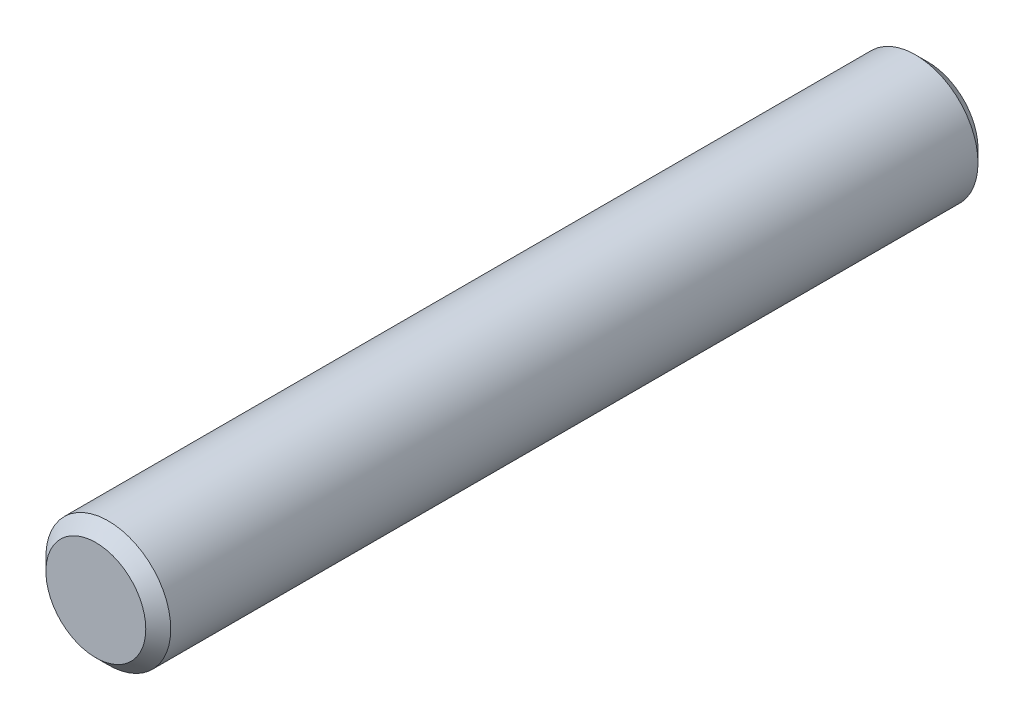
ISO-10303-21;
HEADER;
FILE_DESCRIPTION(('STEP AP214'),'2;1');
FILE_NAME('part.step','',(''),(''),'','','');
FILE_SCHEMA(('AUTOMOTIVE_DESIGN { 1 0 10303 214 1 1 1 1 }'));
ENDSEC;
DATA;
#1=APPLICATION_CONTEXT('core data for automotive mechanical design processes');
#2=APPLICATION_PROTOCOL_DEFINITION('international standard','automotive_design',2000,#1);
#3=PRODUCT_CONTEXT('',#1,'mechanical');
#4=PRODUCT('Part','Part','',(#3));
#5=PRODUCT_RELATED_PRODUCT_CATEGORY('part','',(#4));
#6=PRODUCT_DEFINITION_FORMATION('','',#4);
#7=PRODUCT_DEFINITION_CONTEXT('part definition',#1,'design');
#8=PRODUCT_DEFINITION('design','',#6,#7);
#9=PRODUCT_DEFINITION_SHAPE('','',#8);
#10=(LENGTH_UNIT() NAMED_UNIT(*) SI_UNIT(.MILLI.,.METRE.));
#11=(NAMED_UNIT(*) PLANE_ANGLE_UNIT() SI_UNIT($,.RADIAN.));
#12=(NAMED_UNIT(*) SI_UNIT($,.STERADIAN.) SOLID_ANGLE_UNIT());
#13=UNCERTAINTY_MEASURE_WITH_UNIT(LENGTH_MEASURE(1.E-05),#10,'distance_accuracy_value','');
#14=(GEOMETRIC_REPRESENTATION_CONTEXT(3) GLOBAL_UNCERTAINTY_ASSIGNED_CONTEXT((#13)) GLOBAL_UNIT_ASSIGNED_CONTEXT((#10,
#11,#12)) REPRESENTATION_CONTEXT('',''));
#15=CARTESIAN_POINT('',(0.,0.,0.));
#16=DIRECTION('',(0.,0.,1.));
#17=DIRECTION('',(1.,0.,0.));
#18=AXIS2_PLACEMENT_3D('',#15,#16,#17);
#19=CARTESIAN_POINT('',(0.,0.,10.));
#20=DIRECTION('',(0.,0.,-1.));
#21=DIRECTION('',(-1.,0.,0.));
#22=AXIS2_PLACEMENT_3D('',#19,#20,#21);
#23=CYLINDRICAL_SURFACE('',#22,1.5);
#24=CARTESIAN_POINT('',(0.,0.,-9.7));
#25=DIRECTION('',(0.,0.,1.));
#26=DIRECTION('',(1.,0.,0.));
#27=AXIS2_PLACEMENT_3D('',#24,#25,#26);
#28=CIRCLE('',#27,1.5);
#29=CARTESIAN_POINT('',(1.5,0.,-9.7));
#30=VERTEX_POINT('',#29);
#31=EDGE_CURVE('E48',#30,#30,#28,.T.);
#32=ORIENTED_EDGE('',*,*,#31,.T.);
#33=EDGE_LOOP('',(#32));
#34=FACE_BOUND('',#33,.T.);
#35=CARTESIAN_POINT('',(0.,0.,9.7));
#36=DIRECTION('',(0.,0.,1.));
#37=DIRECTION('',(1.,0.,0.));
#38=AXIS2_PLACEMENT_3D('',#35,#36,#37);
#39=CIRCLE('',#38,1.5);
#40=CARTESIAN_POINT('',(1.5,0.,9.7));
#41=VERTEX_POINT('',#40);
#42=EDGE_CURVE('E52',#41,#41,#39,.F.);
#43=ORIENTED_EDGE('',*,*,#42,.T.);
#44=EDGE_LOOP('',(#43));
#45=FACE_BOUND('',#44,.T.);
#46=ADVANCED_FACE('F36',(#34,#45),#23,.T.);
#47=CARTESIAN_POINT('',(0.,0.,10.));
#48=DIRECTION('',(0.,0.,1.));
#49=DIRECTION('',(1.,0.,0.));
#50=AXIS2_PLACEMENT_3D('',#47,#48,#49);
#51=PLANE('',#50);
#52=CARTESIAN_POINT('',(0.,0.,10.));
#53=DIRECTION('',(0.,0.,1.));
#54=DIRECTION('',(1.,0.,0.));
#55=AXIS2_PLACEMENT_3D('',#52,#53,#54);
#56=CIRCLE('',#55,1.2);
#57=CARTESIAN_POINT('',(1.2,0.,10.));
#58=VERTEX_POINT('',#57);
#59=EDGE_CURVE('E10',#58,#58,#56,.T.);
#60=ORIENTED_EDGE('',*,*,#59,.T.);
#61=EDGE_LOOP('',(#60));
#62=FACE_BOUND('',#61,.T.);
#63=ADVANCED_FACE('F68',(#62),#51,.T.);
#64=CARTESIAN_POINT('',(0.,0.,-10.));
#65=DIRECTION('',(0.,0.,1.));
#66=DIRECTION('',(1.,0.,0.));
#67=AXIS2_PLACEMENT_3D('',#64,#65,#66);
#68=PLANE('',#67);
#69=CARTESIAN_POINT('',(0.,0.,-10.));
#70=DIRECTION('',(0.,0.,1.));
#71=DIRECTION('',(1.,0.,0.));
#72=AXIS2_PLACEMENT_3D('',#69,#70,#71);
#73=CIRCLE('',#72,1.2);
#74=CARTESIAN_POINT('',(1.2,0.,-10.));
#75=VERTEX_POINT('',#74);
#76=EDGE_CURVE('E44',#75,#75,#73,.F.);
#77=ORIENTED_EDGE('',*,*,#76,.T.);
#78=EDGE_LOOP('',(#77));
#79=FACE_BOUND('',#78,.T.);
#80=ADVANCED_FACE('F65',(#79),#68,.F.);
#81=CARTESIAN_POINT('',(0.,0.,-9.7));
#82=DIRECTION('',(0.,0.,1.));
#83=DIRECTION('',(1.,0.,0.));
#84=AXIS2_PLACEMENT_3D('',#81,#82,#83);
#85=CONICAL_SURFACE('',#84,1.5,0.785398163397452);
#86=ORIENTED_EDGE('',*,*,#76,.F.);
#87=EDGE_LOOP('',(#86));
#88=FACE_BOUND('',#87,.T.);
#89=ORIENTED_EDGE('',*,*,#31,.F.);
#90=EDGE_LOOP('',(#89));
#91=FACE_BOUND('',#90,.T.);
#92=ADVANCED_FACE('F61',(#88,#91),#85,.T.);
#93=CARTESIAN_POINT('',(0.,0.,10.));
#94=DIRECTION('',(0.,0.,-1.));
#95=DIRECTION('',(-1.,0.,0.));
#96=AXIS2_PLACEMENT_3D('',#93,#94,#95);
#97=CONICAL_SURFACE('',#96,1.2,0.785398163397447);
#98=ORIENTED_EDGE('',*,*,#42,.F.);
#99=EDGE_LOOP('',(#98));
#100=FACE_BOUND('',#99,.T.);
#101=ORIENTED_EDGE('',*,*,#59,.F.);
#102=EDGE_LOOP('',(#101));
#103=FACE_BOUND('',#102,.T.);
#104=ADVANCED_FACE('F39',(#100,#103),#97,.T.);
#105=CLOSED_SHELL('',(#46,#63,#80,#92,#104));
#106=MANIFOLD_SOLID_BREP('B2',#105);
#107=ADVANCED_BREP_SHAPE_REPRESENTATION('',(#18,#106),#14);
#108=SHAPE_DEFINITION_REPRESENTATION(#9,#107);
ENDSEC;
END-ISO-10303-21;
